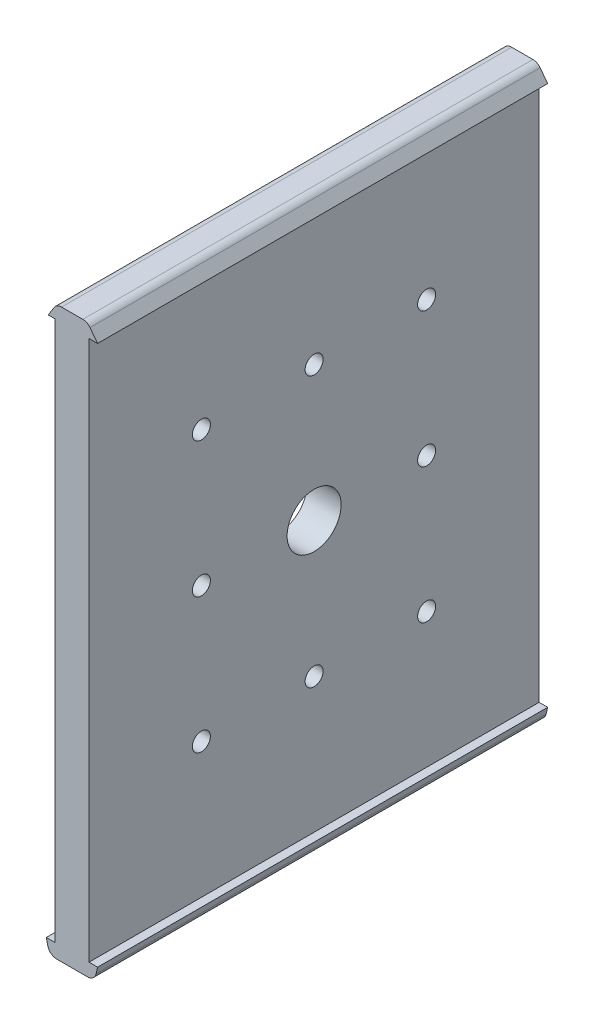
ISO-10303-21;
HEADER;
FILE_DESCRIPTION(('STEP AP214'),'2;1');
FILE_NAME('part.step','',(''),(''),'','','');
FILE_SCHEMA(('AUTOMOTIVE_DESIGN { 1 0 10303 214 1 1 1 1 }'));
ENDSEC;
DATA;
#1=APPLICATION_CONTEXT('core data for automotive mechanical design processes');
#2=APPLICATION_PROTOCOL_DEFINITION('international standard','automotive_design',2000,#1);
#3=PRODUCT_CONTEXT('',#1,'mechanical');
#4=PRODUCT('Part','Part','',(#3));
#5=PRODUCT_RELATED_PRODUCT_CATEGORY('part','',(#4));
#6=PRODUCT_DEFINITION_FORMATION('','',#4);
#7=PRODUCT_DEFINITION_CONTEXT('part definition',#1,'design');
#8=PRODUCT_DEFINITION('design','',#6,#7);
#9=PRODUCT_DEFINITION_SHAPE('','',#8);
#10=(LENGTH_UNIT() NAMED_UNIT(*) SI_UNIT(.MILLI.,.METRE.));
#11=(NAMED_UNIT(*) PLANE_ANGLE_UNIT() SI_UNIT($,.RADIAN.));
#12=(NAMED_UNIT(*) SI_UNIT($,.STERADIAN.) SOLID_ANGLE_UNIT());
#13=UNCERTAINTY_MEASURE_WITH_UNIT(LENGTH_MEASURE(1.E-05),#10,'distance_accuracy_value','');
#14=(GEOMETRIC_REPRESENTATION_CONTEXT(3) GLOBAL_UNCERTAINTY_ASSIGNED_CONTEXT((#13)) GLOBAL_UNIT_ASSIGNED_CONTEXT((#10,
#11,#12)) REPRESENTATION_CONTEXT('',''));
#15=CARTESIAN_POINT('',(0.,0.,0.));
#16=DIRECTION('',(0.,0.,1.));
#17=DIRECTION('',(1.,0.,0.));
#18=AXIS2_PLACEMENT_3D('',#15,#16,#17);
#19=CARTESIAN_POINT('',(-7.17106379094956E-13,-98.178624658982,160.));
#20=DIRECTION('',(0.,1.,0.));
#21=DIRECTION('',(-1.,0.,0.));
#22=AXIS2_PLACEMENT_3D('',#19,#20,#21);
#23=PLANE('',#22);
#24=DIRECTION('',(1.,0.,0.));
#25=VECTOR('',#24,1.);
#26=CARTESIAN_POINT('',(-7.17106379094956E-13,-98.178624658982,30.));
#27=LINE('',#26,#25);
#28=CARTESIAN_POINT('',(-5.69999999999999,-98.178624658982,30.));
#29=VERTEX_POINT('',#28);
#30=CARTESIAN_POINT('',(-3.79999999999998,-98.178624658982,30.));
#31=VERTEX_POINT('',#30);
#32=EDGE_CURVE('E243',#29,#31,#27,.T.);
#33=ORIENTED_EDGE('',*,*,#32,.F.);
#34=DIRECTION('',(0.,0.,-1.));
#35=VECTOR('',#34,1.);
#36=CARTESIAN_POINT('',(-5.69999999999999,-98.178624658982,160.));
#37=LINE('',#36,#35);
#38=CARTESIAN_POINT('',(-5.69999999999999,-98.178624658982,130.));
#39=VERTEX_POINT('',#38);
#40=EDGE_CURVE('E210',#39,#29,#37,.T.);
#41=ORIENTED_EDGE('',*,*,#40,.F.);
#42=DIRECTION('',(-1.,0.,0.));
#43=VECTOR('',#42,1.);
#44=CARTESIAN_POINT('',(-7.17106379094956E-13,-98.178624658982,130.));
#45=LINE('',#44,#43);
#46=CARTESIAN_POINT('',(-3.8,-98.178624658982,130.));
#47=VERTEX_POINT('',#46);
#48=EDGE_CURVE('E262',#47,#39,#45,.T.);
#49=ORIENTED_EDGE('',*,*,#48,.F.);
#50=DIRECTION('',(0.,0.,-1.));
#51=VECTOR('',#50,1.);
#52=CARTESIAN_POINT('',(-3.79999999999998,-98.178624658982,160.));
#53=LINE('',#52,#51);
#54=EDGE_CURVE('E204',#47,#31,#53,.T.);
#55=ORIENTED_EDGE('',*,*,#54,.T.);
#56=EDGE_LOOP('',(#33,#41,#49,#55));
#57=FACE_BOUND('',#56,.T.);
#58=ADVANCED_FACE('F44',(#57),#23,.T.);
#59=CARTESIAN_POINT('',(0.,21.821375341018,160.));
#60=DIRECTION('',(0.,-1.,0.));
#61=DIRECTION('',(0.,0.,-1.));
#62=AXIS2_PLACEMENT_3D('',#59,#60,#61);
#63=PLANE('',#62);
#64=DIRECTION('',(-1.,0.,0.));
#65=VECTOR('',#64,1.);
#66=CARTESIAN_POINT('',(0.,21.821375341018,30.));
#67=LINE('',#66,#65);
#68=CARTESIAN_POINT('',(5.70000000000001,21.821375341018,30.));
#69=VERTEX_POINT('',#68);
#70=CARTESIAN_POINT('',(3.8,21.821375341018,30.));
#71=VERTEX_POINT('',#70);
#72=EDGE_CURVE('E379',#69,#71,#67,.T.);
#73=ORIENTED_EDGE('',*,*,#72,.F.);
#74=DIRECTION('',(0.,0.,-1.));
#75=VECTOR('',#74,1.);
#76=CARTESIAN_POINT('',(5.70000000000001,21.821375341018,160.));
#77=LINE('',#76,#75);
#78=CARTESIAN_POINT('',(5.70000000000001,21.821375341018,130.));
#79=VERTEX_POINT('',#78);
#80=EDGE_CURVE('E186',#79,#69,#77,.T.);
#81=ORIENTED_EDGE('',*,*,#80,.F.);
#82=DIRECTION('',(1.,0.,0.));
#83=VECTOR('',#82,1.);
#84=CARTESIAN_POINT('',(0.,21.821375341018,130.));
#85=LINE('',#84,#83);
#86=CARTESIAN_POINT('',(3.8,21.821375341018,130.));
#87=VERTEX_POINT('',#86);
#88=EDGE_CURVE('E268',#87,#79,#85,.T.);
#89=ORIENTED_EDGE('',*,*,#88,.F.);
#90=DIRECTION('',(0.,0.,-1.));
#91=VECTOR('',#90,1.);
#92=CARTESIAN_POINT('',(3.8,21.821375341018,160.));
#93=LINE('',#92,#91);
#94=EDGE_CURVE('E189',#87,#71,#93,.T.);
#95=ORIENTED_EDGE('',*,*,#94,.T.);
#96=EDGE_LOOP('',(#73,#81,#89,#95));
#97=FACE_BOUND('',#96,.T.);
#98=ADVANCED_FACE('F377',(#97),#63,.T.);
#99=CARTESIAN_POINT('',(-3.8,0.,160.));
#100=DIRECTION('',(-1.,0.,0.));
#101=DIRECTION('',(0.,-1.,0.));
#102=AXIS2_PLACEMENT_3D('',#99,#100,#101);
#103=PLANE('',#102);
#104=CARTESIAN_POINT('',(-3.79999999999999,-38.178624658982,80.));
#105=DIRECTION('',(-1.,0.,0.));
#106=DIRECTION('',(0.,-1.,0.));
#107=AXIS2_PLACEMENT_3D('',#104,#105,#106);
#108=CIRCLE('',#107,6.);
#109=CARTESIAN_POINT('',(-3.79999999999999,-44.1786246589821,80.));
#110=VERTEX_POINT('',#109);
#111=EDGE_CURVE('E173',#110,#110,#108,.T.);
#112=ORIENTED_EDGE('',*,*,#111,.F.);
#113=EDGE_LOOP('',(#112));
#114=FACE_BOUND('',#113,.T.);
#115=CARTESIAN_POINT('',(-3.79999999999999,-38.178624658982,105.042568922673));
#116=DIRECTION('',(-1.,0.,0.));
#117=DIRECTION('',(0.,-1.,0.));
#118=AXIS2_PLACEMENT_3D('',#115,#116,#117);
#119=CIRCLE('',#118,2.);
#120=CARTESIAN_POINT('',(-3.79999999999999,-40.178624658982,105.042568922673));
#121=VERTEX_POINT('',#120);
#122=EDGE_CURVE('E286',#121,#121,#119,.F.);
#123=ORIENTED_EDGE('',*,*,#122,.T.);
#124=EDGE_LOOP('',(#123));
#125=FACE_BOUND('',#124,.T.);
#126=CARTESIAN_POINT('',(-3.79999999999999,-8.17862465898205,55.));
#127=DIRECTION('',(-1.,0.,0.));
#128=DIRECTION('',(0.,-1.,0.));
#129=AXIS2_PLACEMENT_3D('',#126,#127,#128);
#130=CIRCLE('',#129,2.);
#131=CARTESIAN_POINT('',(-3.79999999999999,-10.178624658982,55.));
#132=VERTEX_POINT('',#131);
#133=EDGE_CURVE('E298',#132,#132,#130,.F.);
#134=ORIENTED_EDGE('',*,*,#133,.T.);
#135=EDGE_LOOP('',(#134));
#136=FACE_BOUND('',#135,.T.);
#137=CARTESIAN_POINT('',(-3.79999999999999,-68.178624658982,55.));
#138=DIRECTION('',(-1.,0.,0.));
#139=DIRECTION('',(0.,-1.,0.));
#140=AXIS2_PLACEMENT_3D('',#137,#138,#139);
#141=CIRCLE('',#140,2.);
#142=CARTESIAN_POINT('',(-3.79999999999999,-70.178624658982,55.));
#143=VERTEX_POINT('',#142);
#144=EDGE_CURVE('E310',#143,#143,#141,.F.);
#145=ORIENTED_EDGE('',*,*,#144,.T.);
#146=EDGE_LOOP('',(#145));
#147=FACE_BOUND('',#146,.T.);
#148=CARTESIAN_POINT('',(-3.79999999999999,-8.17862465898205,80.));
#149=DIRECTION('',(-1.,0.,0.));
#150=DIRECTION('',(0.,-1.,0.));
#151=AXIS2_PLACEMENT_3D('',#148,#149,#150);
#152=CIRCLE('',#151,2.);
#153=CARTESIAN_POINT('',(-3.79999999999999,-10.178624658982,80.));
#154=VERTEX_POINT('',#153);
#155=EDGE_CURVE('E322',#154,#154,#152,.F.);
#156=ORIENTED_EDGE('',*,*,#155,.T.);
#157=EDGE_LOOP('',(#156));
#158=FACE_BOUND('',#157,.T.);
#159=DIRECTION('',(0.,-1.,0.));
#160=VECTOR('',#159,1.);
#161=CARTESIAN_POINT('',(-3.8,21.821375341018,130.));
#162=LINE('',#161,#160);
#163=CARTESIAN_POINT('',(-3.8,21.821375341018,130.));
#164=VERTEX_POINT('',#163);
#165=EDGE_CURVE('E326',#164,#47,#162,.T.);
#166=ORIENTED_EDGE('',*,*,#165,.F.);
#167=DIRECTION('',(0.,0.,-1.));
#168=VECTOR('',#167,1.);
#169=CARTESIAN_POINT('',(-3.8,21.821375341018,160.));
#170=LINE('',#169,#168);
#171=CARTESIAN_POINT('',(-3.8,21.821375341018,30.));
#172=VERTEX_POINT('',#171);
#173=EDGE_CURVE('E201',#164,#172,#170,.T.);
#174=ORIENTED_EDGE('',*,*,#173,.T.);
#175=DIRECTION('',(0.,-1.,0.));
#176=VECTOR('',#175,1.);
#177=CARTESIAN_POINT('',(-3.8,21.821375341018,30.));
#178=LINE('',#177,#176);
#179=EDGE_CURVE('E329',#172,#31,#178,.T.);
#180=ORIENTED_EDGE('',*,*,#179,.T.);
#181=ORIENTED_EDGE('',*,*,#54,.F.);
#182=EDGE_LOOP('',(#166,#174,#180,#181));
#183=FACE_BOUND('',#182,.T.);
#184=CARTESIAN_POINT('',(-3.79999999999999,-68.178624658982,80.));
#185=DIRECTION('',(-1.,0.,0.));
#186=DIRECTION('',(0.,-1.,0.));
#187=AXIS2_PLACEMENT_3D('',#184,#185,#186);
#188=CIRCLE('',#187,2.);
#189=CARTESIAN_POINT('',(-3.79999999999999,-70.178624658982,80.));
#190=VERTEX_POINT('',#189);
#191=EDGE_CURVE('E316',#190,#190,#188,.F.);
#192=ORIENTED_EDGE('',*,*,#191,.T.);
#193=EDGE_LOOP('',(#192));
#194=FACE_BOUND('',#193,.T.);
#195=CARTESIAN_POINT('',(-3.79999999999999,-38.178624658982,55.));
#196=DIRECTION('',(-1.,0.,0.));
#197=DIRECTION('',(0.,-1.,0.));
#198=AXIS2_PLACEMENT_3D('',#195,#196,#197);
#199=CIRCLE('',#198,2.);
#200=CARTESIAN_POINT('',(-3.79999999999999,-40.178624658982,55.));
#201=VERTEX_POINT('',#200);
#202=EDGE_CURVE('E304',#201,#201,#199,.F.);
#203=ORIENTED_EDGE('',*,*,#202,.T.);
#204=EDGE_LOOP('',(#203));
#205=FACE_BOUND('',#204,.T.);
#206=CARTESIAN_POINT('',(-3.79999999999999,-68.178624658982,105.042568922673));
#207=DIRECTION('',(-1.,0.,0.));
#208=DIRECTION('',(0.,-1.,0.));
#209=AXIS2_PLACEMENT_3D('',#206,#207,#208);
#210=CIRCLE('',#209,2.);
#211=CARTESIAN_POINT('',(-3.79999999999999,-70.178624658982,105.042568922673));
#212=VERTEX_POINT('',#211);
#213=EDGE_CURVE('E292',#212,#212,#210,.F.);
#214=ORIENTED_EDGE('',*,*,#213,.T.);
#215=EDGE_LOOP('',(#214));
#216=FACE_BOUND('',#215,.T.);
#217=CARTESIAN_POINT('',(-3.79999999999999,-8.17862465898205,105.042568922673));
#218=DIRECTION('',(-1.,0.,0.));
#219=DIRECTION('',(0.,-1.,0.));
#220=AXIS2_PLACEMENT_3D('',#217,#218,#219);
#221=CIRCLE('',#220,2.);
#222=CARTESIAN_POINT('',(-3.79999999999999,-10.178624658982,105.042568922673));
#223=VERTEX_POINT('',#222);
#224=EDGE_CURVE('E280',#223,#223,#221,.F.);
#225=ORIENTED_EDGE('',*,*,#224,.T.);
#226=EDGE_LOOP('',(#225));
#227=FACE_BOUND('',#226,.T.);
#228=ADVANCED_FACE('F46',(#114,#125,#136,#147,#158,#183,#194,#205,#216,#227),#103,.T.);
#229=CARTESIAN_POINT('',(3.8,0.,160.));
#230=DIRECTION('',(-1.,0.,0.));
#231=DIRECTION('',(0.,-1.,0.));
#232=AXIS2_PLACEMENT_3D('',#229,#230,#231);
#233=PLANE('',#232);
#234=CARTESIAN_POINT('',(3.80000000000001,-38.178624658982,80.));
#235=DIRECTION('',(-1.,0.,0.));
#236=DIRECTION('',(0.,-1.,0.));
#237=AXIS2_PLACEMENT_3D('',#234,#235,#236);
#238=CIRCLE('',#237,6.);
#239=CARTESIAN_POINT('',(3.80000000000001,-44.1786246589821,80.));
#240=VERTEX_POINT('',#239);
#241=EDGE_CURVE('E48',#240,#240,#238,.T.);
#242=ORIENTED_EDGE('',*,*,#241,.T.);
#243=EDGE_LOOP('',(#242));
#244=FACE_BOUND('',#243,.T.);
#245=CARTESIAN_POINT('',(3.80000000000001,-38.178624658982,105.042568922673));
#246=DIRECTION('',(1.,0.,0.));
#247=DIRECTION('',(0.,0.,-1.));
#248=AXIS2_PLACEMENT_3D('',#245,#246,#247);
#249=CIRCLE('',#248,2.);
#250=CARTESIAN_POINT('',(3.80000000000001,-38.178624658982,103.042568922673));
#251=VERTEX_POINT('',#250);
#252=EDGE_CURVE('E283',#251,#251,#249,.T.);
#253=ORIENTED_EDGE('',*,*,#252,.F.);
#254=EDGE_LOOP('',(#253));
#255=FACE_BOUND('',#254,.T.);
#256=CARTESIAN_POINT('',(3.8,-8.17862465898205,55.));
#257=DIRECTION('',(1.,0.,0.));
#258=DIRECTION('',(0.,0.,-1.));
#259=AXIS2_PLACEMENT_3D('',#256,#257,#258);
#260=CIRCLE('',#259,2.);
#261=CARTESIAN_POINT('',(3.8,-8.17862465898205,53.));
#262=VERTEX_POINT('',#261);
#263=EDGE_CURVE('E295',#262,#262,#260,.T.);
#264=ORIENTED_EDGE('',*,*,#263,.F.);
#265=EDGE_LOOP('',(#264));
#266=FACE_BOUND('',#265,.T.);
#267=CARTESIAN_POINT('',(3.80000000000002,-68.178624658982,55.));
#268=DIRECTION('',(1.,0.,0.));
#269=DIRECTION('',(0.,0.,-1.));
#270=AXIS2_PLACEMENT_3D('',#267,#268,#269);
#271=CIRCLE('',#270,2.);
#272=CARTESIAN_POINT('',(3.80000000000002,-68.178624658982,53.));
#273=VERTEX_POINT('',#272);
#274=EDGE_CURVE('E307',#273,#273,#271,.T.);
#275=ORIENTED_EDGE('',*,*,#274,.F.);
#276=EDGE_LOOP('',(#275));
#277=FACE_BOUND('',#276,.T.);
#278=CARTESIAN_POINT('',(3.8,-8.17862465898205,80.));
#279=DIRECTION('',(1.,0.,0.));
#280=DIRECTION('',(0.,0.,-1.));
#281=AXIS2_PLACEMENT_3D('',#278,#279,#280);
#282=CIRCLE('',#281,2.);
#283=CARTESIAN_POINT('',(3.8,-8.17862465898205,78.));
#284=VERTEX_POINT('',#283);
#285=EDGE_CURVE('E319',#284,#284,#282,.T.);
#286=ORIENTED_EDGE('',*,*,#285,.F.);
#287=EDGE_LOOP('',(#286));
#288=FACE_BOUND('',#287,.T.);
#289=ORIENTED_EDGE('',*,*,#94,.F.);
#290=DIRECTION('',(0.,1.,0.));
#291=VECTOR('',#290,1.);
#292=CARTESIAN_POINT('',(3.80000000000002,21.821375341018,130.));
#293=LINE('',#292,#291);
#294=CARTESIAN_POINT('',(3.80000000000002,-98.178624658982,130.));
#295=VERTEX_POINT('',#294);
#296=EDGE_CURVE('E325',#295,#87,#293,.T.);
#297=ORIENTED_EDGE('',*,*,#296,.F.);
#298=DIRECTION('',(0.,0.,-1.));
#299=VECTOR('',#298,1.);
#300=CARTESIAN_POINT('',(3.80000000000002,-98.178624658982,160.));
#301=LINE('',#300,#299);
#302=CARTESIAN_POINT('',(3.80000000000002,-98.178624658982,30.));
#303=VERTEX_POINT('',#302);
#304=EDGE_CURVE('E198',#295,#303,#301,.T.);
#305=ORIENTED_EDGE('',*,*,#304,.T.);
#306=DIRECTION('',(0.,1.,0.));
#307=VECTOR('',#306,1.);
#308=CARTESIAN_POINT('',(3.80000000000002,21.821375341018,30.));
#309=LINE('',#308,#307);
#310=EDGE_CURVE('E338',#303,#71,#309,.T.);
#311=ORIENTED_EDGE('',*,*,#310,.T.);
#312=EDGE_LOOP('',(#289,#297,#305,#311));
#313=FACE_BOUND('',#312,.T.);
#314=CARTESIAN_POINT('',(3.80000000000002,-68.178624658982,80.));
#315=DIRECTION('',(1.,0.,0.));
#316=DIRECTION('',(0.,0.,-1.));
#317=AXIS2_PLACEMENT_3D('',#314,#315,#316);
#318=CIRCLE('',#317,2.);
#319=CARTESIAN_POINT('',(3.80000000000002,-68.178624658982,78.));
#320=VERTEX_POINT('',#319);
#321=EDGE_CURVE('E313',#320,#320,#318,.T.);
#322=ORIENTED_EDGE('',*,*,#321,.F.);
#323=EDGE_LOOP('',(#322));
#324=FACE_BOUND('',#323,.T.);
#325=CARTESIAN_POINT('',(3.80000000000001,-38.178624658982,55.));
#326=DIRECTION('',(1.,0.,0.));
#327=DIRECTION('',(0.,0.,-1.));
#328=AXIS2_PLACEMENT_3D('',#325,#326,#327);
#329=CIRCLE('',#328,2.);
#330=CARTESIAN_POINT('',(3.80000000000001,-38.178624658982,53.));
#331=VERTEX_POINT('',#330);
#332=EDGE_CURVE('E301',#331,#331,#329,.T.);
#333=ORIENTED_EDGE('',*,*,#332,.F.);
#334=EDGE_LOOP('',(#333));
#335=FACE_BOUND('',#334,.T.);
#336=CARTESIAN_POINT('',(3.80000000000002,-68.178624658982,105.042568922673));
#337=DIRECTION('',(1.,0.,0.));
#338=DIRECTION('',(0.,0.,-1.));
#339=AXIS2_PLACEMENT_3D('',#336,#337,#338);
#340=CIRCLE('',#339,2.);
#341=CARTESIAN_POINT('',(3.80000000000002,-68.178624658982,103.042568922673));
#342=VERTEX_POINT('',#341);
#343=EDGE_CURVE('E289',#342,#342,#340,.T.);
#344=ORIENTED_EDGE('',*,*,#343,.F.);
#345=EDGE_LOOP('',(#344));
#346=FACE_BOUND('',#345,.T.);
#347=CARTESIAN_POINT('',(3.8,-8.17862465898205,105.042568922673));
#348=DIRECTION('',(1.,0.,0.));
#349=DIRECTION('',(0.,0.,-1.));
#350=AXIS2_PLACEMENT_3D('',#347,#348,#349);
#351=CIRCLE('',#350,2.);
#352=CARTESIAN_POINT('',(3.8,-8.17862465898205,103.042568922673));
#353=VERTEX_POINT('',#352);
#354=EDGE_CURVE('E277',#353,#353,#351,.T.);
#355=ORIENTED_EDGE('',*,*,#354,.F.);
#356=EDGE_LOOP('',(#355));
#357=FACE_BOUND('',#356,.T.);
#358=ADVANCED_FACE('F372',(#244,#255,#266,#277,#288,#313,#324,#335,#346,#357),#233,.F.);
#359=CARTESIAN_POINT('',(-27.1312025062026,-6.33061391811397,160.));
#360=DIRECTION('',(-0.973841209741793,-0.227229615606419,0.));
#361=DIRECTION('',(0.227229615606419,-0.973841209741793,0.));
#362=AXIS2_PLACEMENT_3D('',#359,#360,#361);
#363=PLANE('',#362);
#364=DIRECTION('',(-0.227229615606419,0.973841209741793,0.));
#365=VECTOR('',#364,1.);
#366=CARTESIAN_POINT('',(-27.1312025062026,-6.33061391811397,30.));
#367=LINE('',#366,#365);
#368=CARTESIAN_POINT('',(-5.36062617938365,-99.6330838901949,30.));
#369=VERTEX_POINT('',#368);
#370=EDGE_CURVE('E255',#369,#29,#367,.T.);
#371=ORIENTED_EDGE('',*,*,#370,.F.);
#372=DIRECTION('',(0.,0.,-1.));
#373=VECTOR('',#372,1.);
#374=CARTESIAN_POINT('',(-5.36062617938366,-99.6330838901949,160.));
#375=LINE('',#374,#373);
#376=CARTESIAN_POINT('',(-5.36062617938366,-99.6330838901949,130.));
#377=VERTEX_POINT('',#376);
#378=EDGE_CURVE('E215',#377,#369,#375,.T.);
#379=ORIENTED_EDGE('',*,*,#378,.F.);
#380=DIRECTION('',(0.227229615606419,-0.973841209741793,0.));
#381=VECTOR('',#380,1.);
#382=CARTESIAN_POINT('',(-27.1312025062026,-6.33061391811397,130.));
#383=LINE('',#382,#381);
#384=EDGE_CURVE('E357',#39,#377,#383,.T.);
#385=ORIENTED_EDGE('',*,*,#384,.F.);
#386=ORIENTED_EDGE('',*,*,#40,.T.);
#387=EDGE_LOOP('',(#371,#379,#385,#386));
#388=FACE_BOUND('',#387,.T.);
#389=ADVANCED_FACE('F436',(#388),#363,.T.);
#390=CARTESIAN_POINT('',(-3.41294375990007,-99.178624658982,160.));
#391=DIRECTION('',(0.,0.,-1.));
#392=DIRECTION('',(-1.,0.,0.));
#393=AXIS2_PLACEMENT_3D('',#390,#391,#392);
#394=CYLINDRICAL_SURFACE('',#393,2.);
#395=ORIENTED_EDGE('',*,*,#378,.T.);
#396=CARTESIAN_POINT('',(-3.41294375990007,-99.178624658982,30.));
#397=DIRECTION('',(0.,0.,1.));
#398=DIRECTION('',(1.,0.,0.));
#399=AXIS2_PLACEMENT_3D('',#396,#397,#398);
#400=CIRCLE('',#399,2.);
#401=CARTESIAN_POINT('',(-3.41294375990007,-101.178624658982,30.));
#402=VERTEX_POINT('',#401);
#403=EDGE_CURVE('E252',#369,#402,#400,.T.);
#404=ORIENTED_EDGE('',*,*,#403,.T.);
#405=DIRECTION('',(0.,0.,-1.));
#406=VECTOR('',#405,1.);
#407=CARTESIAN_POINT('',(-3.41294375990007,-101.178624658982,160.));
#408=LINE('',#407,#406);
#409=CARTESIAN_POINT('',(-3.41294375990007,-101.178624658982,130.));
#410=VERTEX_POINT('',#409);
#411=EDGE_CURVE('E218',#410,#402,#408,.T.);
#412=ORIENTED_EDGE('',*,*,#411,.F.);
#413=CARTESIAN_POINT('',(-3.41294375990007,-99.178624658982,130.));
#414=DIRECTION('',(0.,0.,-1.));
#415=DIRECTION('',(-1.,0.,0.));
#416=AXIS2_PLACEMENT_3D('',#413,#414,#415);
#417=CIRCLE('',#416,2.);
#418=EDGE_CURVE('E358',#410,#377,#417,.T.);
#419=ORIENTED_EDGE('',*,*,#418,.T.);
#420=EDGE_LOOP('',(#395,#404,#412,#419));
#421=FACE_BOUND('',#420,.T.);
#422=ADVANCED_FACE('F433',(#421),#394,.T.);
#423=CARTESIAN_POINT('',(0.,-101.178624658982,160.));
#424=DIRECTION('',(0.,1.,0.));
#425=DIRECTION('',(0.,0.,1.));
#426=AXIS2_PLACEMENT_3D('',#423,#424,#425);
#427=PLANE('',#426);
#428=ORIENTED_EDGE('',*,*,#411,.T.);
#429=DIRECTION('',(1.,0.,0.));
#430=VECTOR('',#429,1.);
#431=CARTESIAN_POINT('',(0.,-101.178624658982,30.));
#432=LINE('',#431,#430);
#433=CARTESIAN_POINT('',(3.4129437599001,-101.178624658982,30.));
#434=VERTEX_POINT('',#433);
#435=EDGE_CURVE('E245',#402,#434,#432,.T.);
#436=ORIENTED_EDGE('',*,*,#435,.T.);
#437=DIRECTION('',(0.,0.,-1.));
#438=VECTOR('',#437,1.);
#439=CARTESIAN_POINT('',(3.4129437599001,-101.178624658982,160.));
#440=LINE('',#439,#438);
#441=CARTESIAN_POINT('',(3.4129437599001,-101.178624658982,130.));
#442=VERTEX_POINT('',#441);
#443=EDGE_CURVE('E221',#442,#434,#440,.T.);
#444=ORIENTED_EDGE('',*,*,#443,.F.);
#445=DIRECTION('',(-1.,0.,0.));
#446=VECTOR('',#445,1.);
#447=CARTESIAN_POINT('',(0.,-101.178624658982,130.));
#448=LINE('',#447,#446);
#449=EDGE_CURVE('E361',#442,#410,#448,.T.);
#450=ORIENTED_EDGE('',*,*,#449,.T.);
#451=EDGE_LOOP('',(#428,#436,#444,#450));
#452=FACE_BOUND('',#451,.T.);
#453=ADVANCED_FACE('F427',(#452),#427,.F.);
#454=CARTESIAN_POINT('',(3.4129437599001,-99.178624658982,160.));
#455=DIRECTION('',(0.,0.,-1.));
#456=DIRECTION('',(-1.,0.,0.));
#457=AXIS2_PLACEMENT_3D('',#454,#455,#456);
#458=CYLINDRICAL_SURFACE('',#457,2.);
#459=ORIENTED_EDGE('',*,*,#443,.T.);
#460=CARTESIAN_POINT('',(3.4129437599001,-99.178624658982,30.));
#461=DIRECTION('',(0.,0.,1.));
#462=DIRECTION('',(1.,0.,0.));
#463=AXIS2_PLACEMENT_3D('',#460,#461,#462);
#464=CIRCLE('',#463,2.);
#465=CARTESIAN_POINT('',(5.3606261793837,-99.6330838901949,30.));
#466=VERTEX_POINT('',#465);
#467=EDGE_CURVE('E242',#434,#466,#464,.T.);
#468=ORIENTED_EDGE('',*,*,#467,.T.);
#469=DIRECTION('',(0.,0.,-1.));
#470=VECTOR('',#469,1.);
#471=CARTESIAN_POINT('',(5.3606261793837,-99.6330838901949,160.));
#472=LINE('',#471,#470);
#473=CARTESIAN_POINT('',(5.36062617938369,-99.6330838901949,130.));
#474=VERTEX_POINT('',#473);
#475=EDGE_CURVE('E224',#474,#466,#472,.T.);
#476=ORIENTED_EDGE('',*,*,#475,.F.);
#477=CARTESIAN_POINT('',(3.4129437599001,-99.178624658982,130.));
#478=DIRECTION('',(0.,0.,-1.));
#479=DIRECTION('',(-1.,0.,0.));
#480=AXIS2_PLACEMENT_3D('',#477,#478,#479);
#481=CIRCLE('',#480,2.);
#482=EDGE_CURVE('E367',#474,#442,#481,.T.);
#483=ORIENTED_EDGE('',*,*,#482,.T.);
#484=EDGE_LOOP('',(#459,#468,#476,#483));
#485=FACE_BOUND('',#484,.T.);
#486=ADVANCED_FACE('F423',(#485),#458,.T.);
#487=CARTESIAN_POINT('',(27.1312025062019,-6.33061391811356,160.));
#488=DIRECTION('',(0.973841209741795,-0.227229615606411,0.));
#489=DIRECTION('',(0.227229615606411,0.973841209741795,0.));
#490=AXIS2_PLACEMENT_3D('',#487,#488,#489);
#491=PLANE('',#490);
#492=DIRECTION('',(-0.227229615606411,-0.973841209741795,0.));
#493=VECTOR('',#492,1.);
#494=CARTESIAN_POINT('',(27.1312025062019,-6.33061391811356,30.));
#495=LINE('',#494,#493);
#496=CARTESIAN_POINT('',(5.70000000000001,-98.1786246589821,30.));
#497=VERTEX_POINT('',#496);
#498=EDGE_CURVE('E240',#497,#466,#495,.T.);
#499=ORIENTED_EDGE('',*,*,#498,.F.);
#500=DIRECTION('',(0.,0.,-1.));
#501=VECTOR('',#500,1.);
#502=CARTESIAN_POINT('',(5.70000000000001,-98.1786246589821,160.));
#503=LINE('',#502,#501);
#504=CARTESIAN_POINT('',(5.70000000000001,-98.1786246589821,130.));
#505=VERTEX_POINT('',#504);
#506=EDGE_CURVE('E207',#505,#497,#503,.T.);
#507=ORIENTED_EDGE('',*,*,#506,.F.);
#508=DIRECTION('',(0.227229615606411,0.973841209741795,0.));
#509=VECTOR('',#508,1.);
#510=CARTESIAN_POINT('',(27.1312025062019,-6.33061391811356,130.));
#511=LINE('',#510,#509);
#512=EDGE_CURVE('E238',#474,#505,#511,.T.);
#513=ORIENTED_EDGE('',*,*,#512,.F.);
#514=ORIENTED_EDGE('',*,*,#475,.T.);
#515=EDGE_LOOP('',(#499,#507,#513,#514));
#516=FACE_BOUND('',#515,.T.);
#517=ADVANCED_FACE('F237',(#516),#491,.T.);
#518=EDGE_CURVE('E232',#303,#497,#27,.T.);
#519=ORIENTED_EDGE('',*,*,#518,.F.);
#520=ORIENTED_EDGE('',*,*,#304,.F.);
#521=EDGE_CURVE('E233',#505,#295,#45,.T.);
#522=ORIENTED_EDGE('',*,*,#521,.F.);
#523=ORIENTED_EDGE('',*,*,#506,.T.);
#524=EDGE_LOOP('',(#519,#520,#522,#523));
#525=FACE_BOUND('',#524,.T.);
#526=ADVANCED_FACE('F230',(#525),#23,.T.);
#527=CARTESIAN_POINT('',(-5.26679924331625,21.821375341018,30.));
#528=VERTEX_POINT('',#527);
#529=EDGE_CURVE('E60',#172,#528,#67,.T.);
#530=ORIENTED_EDGE('',*,*,#529,.F.);
#531=ORIENTED_EDGE('',*,*,#173,.F.);
#532=CARTESIAN_POINT('',(-5.26679924331625,21.821375341018,130.));
#533=VERTEX_POINT('',#532);
#534=EDGE_CURVE('E260',#533,#164,#85,.T.);
#535=ORIENTED_EDGE('',*,*,#534,.F.);
#536=DIRECTION('',(0.,0.,-1.));
#537=VECTOR('',#536,1.);
#538=CARTESIAN_POINT('',(-5.26679924331625,21.821375341018,160.));
#539=LINE('',#538,#537);
#540=EDGE_CURVE('E180',#533,#528,#539,.T.);
#541=ORIENTED_EDGE('',*,*,#540,.T.);
#542=EDGE_LOOP('',(#530,#531,#535,#541));
#543=FACE_BOUND('',#542,.T.);
#544=ADVANCED_FACE('F344',(#543),#63,.T.);
#545=CARTESIAN_POINT('',(14.1258813531818,10.7688950319018,160.));
#546=DIRECTION('',(-0.795260200775992,-0.606268268229279,0.));
#547=DIRECTION('',(0.606268268229279,-0.795260200775992,0.));
#548=AXIS2_PLACEMENT_3D('',#545,#546,#547);
#549=PLANE('',#548);
#550=ORIENTED_EDGE('',*,*,#80,.T.);
#551=DIRECTION('',(-0.606268268229279,0.795260200775992,0.));
#552=VECTOR('',#551,1.);
#553=CARTESIAN_POINT('',(14.1258813531818,10.7688950319018,30.));
#554=LINE('',#553,#552);
#555=CARTESIAN_POINT('',(4.01326816928115,24.0339118774765,30.));
#556=VERTEX_POINT('',#555);
#557=EDGE_CURVE('E385',#69,#556,#554,.T.);
#558=ORIENTED_EDGE('',*,*,#557,.T.);
#559=DIRECTION('',(0.,0.,-1.));
#560=VECTOR('',#559,1.);
#561=CARTESIAN_POINT('',(4.01326816928115,24.0339118774765,160.));
#562=LINE('',#561,#560);
#563=CARTESIAN_POINT('',(4.01326816928115,24.0339118774765,130.));
#564=VERTEX_POINT('',#563);
#565=EDGE_CURVE('E178',#564,#556,#562,.T.);
#566=ORIENTED_EDGE('',*,*,#565,.F.);
#567=DIRECTION('',(0.606268268229279,-0.795260200775992,0.));
#568=VECTOR('',#567,1.);
#569=CARTESIAN_POINT('',(14.1258813531818,10.7688950319018,130.));
#570=LINE('',#569,#568);
#571=EDGE_CURVE('E271',#564,#79,#570,.T.);
#572=ORIENTED_EDGE('',*,*,#571,.T.);
#573=EDGE_LOOP('',(#550,#558,#566,#572));
#574=FACE_BOUND('',#573,.T.);
#575=ADVANCED_FACE('F383',(#574),#549,.F.);
#576=CARTESIAN_POINT('',(2.42274776772917,22.8213753410179,160.));
#577=DIRECTION('',(0.,0.,-1.));
#578=DIRECTION('',(-1.,0.,0.));
#579=AXIS2_PLACEMENT_3D('',#576,#577,#578);
#580=CYLINDRICAL_SURFACE('',#579,2.);
#581=CARTESIAN_POINT('',(2.42274776772917,22.8213753410179,30.));
#582=DIRECTION('',(0.,0.,1.));
#583=DIRECTION('',(1.,0.,0.));
#584=AXIS2_PLACEMENT_3D('',#581,#582,#583);
#585=CIRCLE('',#584,2.);
#586=CARTESIAN_POINT('',(2.42274776772917,24.821375341018,30.));
#587=VERTEX_POINT('',#586);
#588=EDGE_CURVE('E388',#587,#556,#585,.F.);
#589=ORIENTED_EDGE('',*,*,#588,.F.);
#590=DIRECTION('',(0.,0.,-1.));
#591=VECTOR('',#590,1.);
#592=CARTESIAN_POINT('',(2.42274776772917,24.821375341018,160.));
#593=LINE('',#592,#591);
#594=CARTESIAN_POINT('',(2.42274776772917,24.821375341018,130.));
#595=VERTEX_POINT('',#594);
#596=EDGE_CURVE('E172',#595,#587,#593,.T.);
#597=ORIENTED_EDGE('',*,*,#596,.F.);
#598=CARTESIAN_POINT('',(2.42274776772917,22.8213753410179,130.));
#599=DIRECTION('',(0.,0.,-1.));
#600=DIRECTION('',(-1.,0.,0.));
#601=AXIS2_PLACEMENT_3D('',#598,#599,#600);
#602=CIRCLE('',#601,2.);
#603=EDGE_CURVE('E275',#564,#595,#602,.F.);
#604=ORIENTED_EDGE('',*,*,#603,.F.);
#605=ORIENTED_EDGE('',*,*,#565,.T.);
#606=EDGE_LOOP('',(#589,#597,#604,#605));
#607=FACE_BOUND('',#606,.T.);
#608=ADVANCED_FACE('F387',(#607),#580,.T.);
#609=CARTESIAN_POINT('',(0.,24.821375341018,160.));
#610=DIRECTION('',(0.,-1.,0.));
#611=DIRECTION('',(1.,0.,0.));
#612=AXIS2_PLACEMENT_3D('',#609,#610,#611);
#613=PLANE('',#612);
#614=ORIENTED_EDGE('',*,*,#596,.T.);
#615=DIRECTION('',(1.,0.,0.));
#616=VECTOR('',#615,1.);
#617=CARTESIAN_POINT('',(-22.,24.821375341018,30.));
#618=LINE('',#617,#616);
#619=CARTESIAN_POINT('',(-2.29779279131514,24.821375341018,30.));
#620=VERTEX_POINT('',#619);
#621=EDGE_CURVE('E158',#620,#587,#618,.T.);
#622=ORIENTED_EDGE('',*,*,#621,.F.);
#623=DIRECTION('',(0.,0.,-1.));
#624=VECTOR('',#623,1.);
#625=CARTESIAN_POINT('',(-2.29779279131514,24.821375341018,160.));
#626=LINE('',#625,#624);
#627=CARTESIAN_POINT('',(-2.29779279131514,24.821375341018,130.));
#628=VERTEX_POINT('',#627);
#629=EDGE_CURVE('E170',#628,#620,#626,.T.);
#630=ORIENTED_EDGE('',*,*,#629,.F.);
#631=DIRECTION('',(1.,0.,0.));
#632=VECTOR('',#631,1.);
#633=CARTESIAN_POINT('',(-22.,24.821375341018,130.));
#634=LINE('',#633,#632);
#635=EDGE_CURVE('E257',#628,#595,#634,.T.);
#636=ORIENTED_EDGE('',*,*,#635,.T.);
#637=EDGE_LOOP('',(#614,#622,#630,#636));
#638=FACE_BOUND('',#637,.T.);
#639=ADVANCED_FACE('F168',(#638),#613,.F.);
#640=CARTESIAN_POINT('',(-2.29779279131514,22.8213753410179,160.));
#641=DIRECTION('',(0.,0.,-1.));
#642=DIRECTION('',(-1.,0.,0.));
#643=AXIS2_PLACEMENT_3D('',#640,#641,#642);
#644=CYLINDRICAL_SURFACE('',#643,2.);
#645=ORIENTED_EDGE('',*,*,#629,.T.);
#646=CARTESIAN_POINT('',(-2.29779279131514,22.8213753410179,30.));
#647=DIRECTION('',(0.,0.,1.));
#648=DIRECTION('',(1.,0.,0.));
#649=AXIS2_PLACEMENT_3D('',#646,#647,#648);
#650=CIRCLE('',#649,2.);
#651=CARTESIAN_POINT('',(-3.99915691907052,23.8727364135269,30.));
#652=VERTEX_POINT('',#651);
#653=EDGE_CURVE('E155',#620,#652,#650,.T.);
#654=ORIENTED_EDGE('',*,*,#653,.T.);
#655=DIRECTION('',(0.,0.,-1.));
#656=VECTOR('',#655,1.);
#657=CARTESIAN_POINT('',(-3.99915691907052,23.8727364135269,160.));
#658=LINE('',#657,#656);
#659=CARTESIAN_POINT('',(-3.99915691907052,23.8727364135269,130.));
#660=VERTEX_POINT('',#659);
#661=EDGE_CURVE('E176',#660,#652,#658,.T.);
#662=ORIENTED_EDGE('',*,*,#661,.F.);
#663=CARTESIAN_POINT('',(-2.29779279131514,22.8213753410179,130.));
#664=DIRECTION('',(0.,0.,-1.));
#665=DIRECTION('',(-1.,0.,0.));
#666=AXIS2_PLACEMENT_3D('',#663,#664,#665);
#667=CIRCLE('',#666,2.);
#668=EDGE_CURVE('E67',#660,#628,#667,.T.);
#669=ORIENTED_EDGE('',*,*,#668,.T.);
#670=EDGE_LOOP('',(#645,#654,#662,#669));
#671=FACE_BOUND('',#670,.T.);
#672=ADVANCED_FACE('F175',(#671),#644,.T.);
#673=CARTESIAN_POINT('',(-13.5696072539082,8.38536360515385,160.));
#674=DIRECTION('',(0.850682063877688,-0.52568053625448,0.));
#675=DIRECTION('',(0.52568053625448,0.850682063877688,0.));
#676=AXIS2_PLACEMENT_3D('',#673,#674,#675);
#677=PLANE('',#676);
#678=ORIENTED_EDGE('',*,*,#661,.T.);
#679=DIRECTION('',(-0.52568053625448,-0.850682063877688,0.));
#680=VECTOR('',#679,1.);
#681=CARTESIAN_POINT('',(-13.5696072539082,8.38536360515385,30.));
#682=LINE('',#681,#680);
#683=EDGE_CURVE('E12',#652,#528,#682,.T.);
#684=ORIENTED_EDGE('',*,*,#683,.T.);
#685=ORIENTED_EDGE('',*,*,#540,.F.);
#686=DIRECTION('',(0.52568053625448,0.850682063877688,0.));
#687=VECTOR('',#686,1.);
#688=CARTESIAN_POINT('',(-13.5696072539082,8.38536360515385,130.));
#689=LINE('',#688,#687);
#690=EDGE_CURVE('E53',#533,#660,#689,.T.);
#691=ORIENTED_EDGE('',*,*,#690,.T.);
#692=EDGE_LOOP('',(#678,#684,#685,#691));
#693=FACE_BOUND('',#692,.T.);
#694=ADVANCED_FACE('F347',(#693),#677,.F.);
#695=CARTESIAN_POINT('',(0.,0.,30.));
#696=DIRECTION('',(0.,0.,1.));
#697=DIRECTION('',(1.,0.,0.));
#698=AXIS2_PLACEMENT_3D('',#695,#696,#697);
#699=PLANE('',#698);
#700=ORIENTED_EDGE('',*,*,#179,.F.);
#701=ORIENTED_EDGE('',*,*,#529,.T.);
#702=ORIENTED_EDGE('',*,*,#683,.F.);
#703=ORIENTED_EDGE('',*,*,#653,.F.);
#704=ORIENTED_EDGE('',*,*,#621,.T.);
#705=ORIENTED_EDGE('',*,*,#588,.T.);
#706=ORIENTED_EDGE('',*,*,#557,.F.);
#707=ORIENTED_EDGE('',*,*,#72,.T.);
#708=ORIENTED_EDGE('',*,*,#310,.F.);
#709=ORIENTED_EDGE('',*,*,#518,.T.);
#710=ORIENTED_EDGE('',*,*,#498,.T.);
#711=ORIENTED_EDGE('',*,*,#467,.F.);
#712=ORIENTED_EDGE('',*,*,#435,.F.);
#713=ORIENTED_EDGE('',*,*,#403,.F.);
#714=ORIENTED_EDGE('',*,*,#370,.T.);
#715=ORIENTED_EDGE('',*,*,#32,.T.);
#716=EDGE_LOOP('',(#700,#701,#702,#703,#704,#705,#706,#707,#708,#709,#710,#711,#712,#713,#714,#715));
#717=FACE_BOUND('',#716,.T.);
#718=ADVANCED_FACE('F157',(#717),#699,.F.);
#719=CARTESIAN_POINT('',(0.,0.,130.));
#720=DIRECTION('',(0.,0.,-1.));
#721=DIRECTION('',(-1.,0.,0.));
#722=AXIS2_PLACEMENT_3D('',#719,#720,#721);
#723=PLANE('',#722);
#724=ORIENTED_EDGE('',*,*,#165,.T.);
#725=ORIENTED_EDGE('',*,*,#48,.T.);
#726=ORIENTED_EDGE('',*,*,#384,.T.);
#727=ORIENTED_EDGE('',*,*,#418,.F.);
#728=ORIENTED_EDGE('',*,*,#449,.F.);
#729=ORIENTED_EDGE('',*,*,#482,.F.);
#730=ORIENTED_EDGE('',*,*,#512,.T.);
#731=ORIENTED_EDGE('',*,*,#521,.T.);
#732=ORIENTED_EDGE('',*,*,#296,.T.);
#733=ORIENTED_EDGE('',*,*,#88,.T.);
#734=ORIENTED_EDGE('',*,*,#571,.F.);
#735=ORIENTED_EDGE('',*,*,#603,.T.);
#736=ORIENTED_EDGE('',*,*,#635,.F.);
#737=ORIENTED_EDGE('',*,*,#668,.F.);
#738=ORIENTED_EDGE('',*,*,#690,.F.);
#739=ORIENTED_EDGE('',*,*,#534,.T.);
#740=EDGE_LOOP('',(#724,#725,#726,#727,#728,#729,#730,#731,#732,#733,#734,#735,#736,#737,#738,#739));
#741=FACE_BOUND('',#740,.T.);
#742=ADVANCED_FACE('F348',(#741),#723,.F.);
#743=CARTESIAN_POINT('',(3.8,-8.17862465898205,80.));
#744=DIRECTION('',(-1.,0.,0.));
#745=DIRECTION('',(0.,-1.,0.));
#746=AXIS2_PLACEMENT_3D('',#743,#744,#745);
#747=CYLINDRICAL_SURFACE('',#746,2.);
#748=ORIENTED_EDGE('',*,*,#155,.F.);
#749=EDGE_LOOP('',(#748));
#750=FACE_BOUND('',#749,.T.);
#751=ORIENTED_EDGE('',*,*,#285,.T.);
#752=EDGE_LOOP('',(#751));
#753=FACE_BOUND('',#752,.T.);
#754=ADVANCED_FACE('F466',(#750,#753),#747,.F.);
#755=CARTESIAN_POINT('',(3.80000000000002,-68.178624658982,80.));
#756=DIRECTION('',(-1.,0.,0.));
#757=DIRECTION('',(0.,-1.,0.));
#758=AXIS2_PLACEMENT_3D('',#755,#756,#757);
#759=CYLINDRICAL_SURFACE('',#758,2.);
#760=ORIENTED_EDGE('',*,*,#191,.F.);
#761=EDGE_LOOP('',(#760));
#762=FACE_BOUND('',#761,.T.);
#763=ORIENTED_EDGE('',*,*,#321,.T.);
#764=EDGE_LOOP('',(#763));
#765=FACE_BOUND('',#764,.T.);
#766=ADVANCED_FACE('F469',(#762,#765),#759,.F.);
#767=CARTESIAN_POINT('',(3.80000000000002,-68.178624658982,55.));
#768=DIRECTION('',(-1.,0.,0.));
#769=DIRECTION('',(0.,-1.,0.));
#770=AXIS2_PLACEMENT_3D('',#767,#768,#769);
#771=CYLINDRICAL_SURFACE('',#770,2.);
#772=ORIENTED_EDGE('',*,*,#144,.F.);
#773=EDGE_LOOP('',(#772));
#774=FACE_BOUND('',#773,.T.);
#775=ORIENTED_EDGE('',*,*,#274,.T.);
#776=EDGE_LOOP('',(#775));
#777=FACE_BOUND('',#776,.T.);
#778=ADVANCED_FACE('F473',(#774,#777),#771,.F.);
#779=CARTESIAN_POINT('',(3.80000000000001,-38.178624658982,55.));
#780=DIRECTION('',(-1.,0.,0.));
#781=DIRECTION('',(0.,-1.,0.));
#782=AXIS2_PLACEMENT_3D('',#779,#780,#781);
#783=CYLINDRICAL_SURFACE('',#782,2.);
#784=ORIENTED_EDGE('',*,*,#202,.F.);
#785=EDGE_LOOP('',(#784));
#786=FACE_BOUND('',#785,.T.);
#787=ORIENTED_EDGE('',*,*,#332,.T.);
#788=EDGE_LOOP('',(#787));
#789=FACE_BOUND('',#788,.T.);
#790=ADVANCED_FACE('F477',(#786,#789),#783,.F.);
#791=CARTESIAN_POINT('',(3.8,-8.17862465898205,55.));
#792=DIRECTION('',(-1.,0.,0.));
#793=DIRECTION('',(0.,-1.,0.));
#794=AXIS2_PLACEMENT_3D('',#791,#792,#793);
#795=CYLINDRICAL_SURFACE('',#794,2.);
#796=ORIENTED_EDGE('',*,*,#133,.F.);
#797=EDGE_LOOP('',(#796));
#798=FACE_BOUND('',#797,.T.);
#799=ORIENTED_EDGE('',*,*,#263,.T.);
#800=EDGE_LOOP('',(#799));
#801=FACE_BOUND('',#800,.T.);
#802=ADVANCED_FACE('F481',(#798,#801),#795,.F.);
#803=CARTESIAN_POINT('',(3.80000000000002,-68.178624658982,105.042568922673));
#804=DIRECTION('',(-1.,0.,0.));
#805=DIRECTION('',(0.,-1.,0.));
#806=AXIS2_PLACEMENT_3D('',#803,#804,#805);
#807=CYLINDRICAL_SURFACE('',#806,2.);
#808=ORIENTED_EDGE('',*,*,#213,.F.);
#809=EDGE_LOOP('',(#808));
#810=FACE_BOUND('',#809,.T.);
#811=ORIENTED_EDGE('',*,*,#343,.T.);
#812=EDGE_LOOP('',(#811));
#813=FACE_BOUND('',#812,.T.);
#814=ADVANCED_FACE('F485',(#810,#813),#807,.F.);
#815=CARTESIAN_POINT('',(3.80000000000001,-38.178624658982,105.042568922673));
#816=DIRECTION('',(-1.,0.,0.));
#817=DIRECTION('',(0.,-1.,0.));
#818=AXIS2_PLACEMENT_3D('',#815,#816,#817);
#819=CYLINDRICAL_SURFACE('',#818,2.);
#820=ORIENTED_EDGE('',*,*,#122,.F.);
#821=EDGE_LOOP('',(#820));
#822=FACE_BOUND('',#821,.T.);
#823=ORIENTED_EDGE('',*,*,#252,.T.);
#824=EDGE_LOOP('',(#823));
#825=FACE_BOUND('',#824,.T.);
#826=ADVANCED_FACE('F407',(#822,#825),#819,.F.);
#827=CARTESIAN_POINT('',(3.8,-8.17862465898205,105.042568922673));
#828=DIRECTION('',(-1.,0.,0.));
#829=DIRECTION('',(0.,-1.,0.));
#830=AXIS2_PLACEMENT_3D('',#827,#828,#829);
#831=CYLINDRICAL_SURFACE('',#830,2.);
#832=ORIENTED_EDGE('',*,*,#224,.F.);
#833=EDGE_LOOP('',(#832));
#834=FACE_BOUND('',#833,.T.);
#835=ORIENTED_EDGE('',*,*,#354,.T.);
#836=EDGE_LOOP('',(#835));
#837=FACE_BOUND('',#836,.T.);
#838=ADVANCED_FACE('F402',(#834,#837),#831,.F.);
#839=CARTESIAN_POINT('',(-22.,-38.178624658982,80.));
#840=DIRECTION('',(1.,0.,0.));
#841=DIRECTION('',(0.,0.,-1.));
#842=AXIS2_PLACEMENT_3D('',#839,#840,#841);
#843=CYLINDRICAL_SURFACE('',#842,6.);
#844=ORIENTED_EDGE('',*,*,#111,.T.);
#845=EDGE_LOOP('',(#844));
#846=FACE_BOUND('',#845,.T.);
#847=ORIENTED_EDGE('',*,*,#241,.F.);
#848=EDGE_LOOP('',(#847));
#849=FACE_BOUND('',#848,.T.);
#850=ADVANCED_FACE('F400',(#846,#849),#843,.F.);
#851=CLOSED_SHELL('',(#58,#98,#228,#358,#389,#422,#453,#486,#517,#526,#544,#575,#608,#639,#672,
#694,#718,#742,#754,#766,#778,#790,#802,#814,#826,#838,#850));
#852=MANIFOLD_SOLID_BREP('B2',#851);
#853=ADVANCED_BREP_SHAPE_REPRESENTATION('',(#18,#852),#14);
#854=SHAPE_DEFINITION_REPRESENTATION(#9,#853);
ENDSEC;
END-ISO-10303-21;
